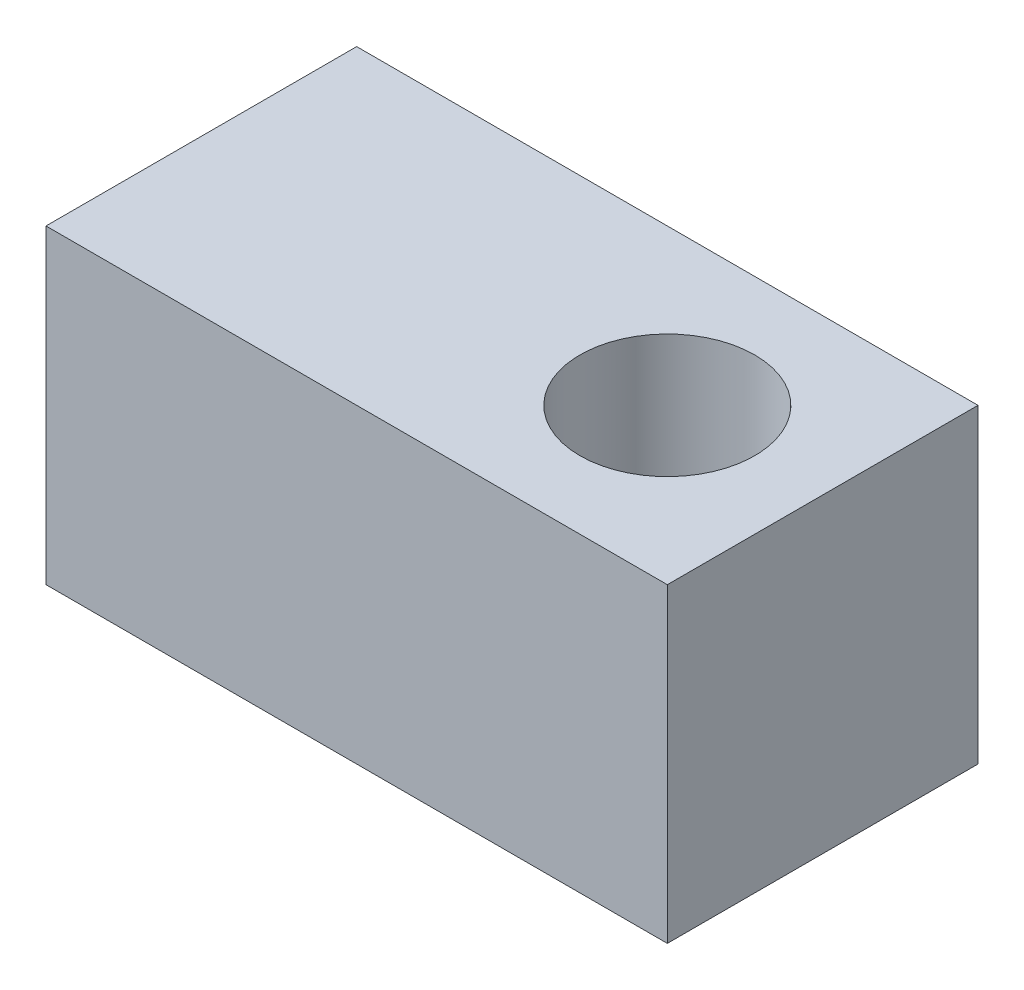
ISO-10303-21;
HEADER;
FILE_DESCRIPTION(('STEP AP214'),'2;1');
FILE_NAME('part.step','',(''),(''),'','','');
FILE_SCHEMA(('AUTOMOTIVE_DESIGN { 1 0 10303 214 1 1 1 1 }'));
ENDSEC;
DATA;
#1=APPLICATION_CONTEXT('core data for automotive mechanical design processes');
#2=APPLICATION_PROTOCOL_DEFINITION('international standard','automotive_design',2000,#1);
#3=PRODUCT_CONTEXT('',#1,'mechanical');
#4=PRODUCT('Part','Part','',(#3));
#5=PRODUCT_RELATED_PRODUCT_CATEGORY('part','',(#4));
#6=PRODUCT_DEFINITION_FORMATION('','',#4);
#7=PRODUCT_DEFINITION_CONTEXT('part definition',#1,'design');
#8=PRODUCT_DEFINITION('design','',#6,#7);
#9=PRODUCT_DEFINITION_SHAPE('','',#8);
#10=(LENGTH_UNIT() NAMED_UNIT(*) SI_UNIT(.MILLI.,.METRE.));
#11=(NAMED_UNIT(*) PLANE_ANGLE_UNIT() SI_UNIT($,.RADIAN.));
#12=(NAMED_UNIT(*) SI_UNIT($,.STERADIAN.) SOLID_ANGLE_UNIT());
#13=UNCERTAINTY_MEASURE_WITH_UNIT(LENGTH_MEASURE(1.E-05),#10,'distance_accuracy_value','');
#14=(GEOMETRIC_REPRESENTATION_CONTEXT(3) GLOBAL_UNCERTAINTY_ASSIGNED_CONTEXT((#13)) GLOBAL_UNIT_ASSIGNED_CONTEXT((#10,
#11,#12)) REPRESENTATION_CONTEXT('',''));
#15=CARTESIAN_POINT('',(0.,0.,0.));
#16=DIRECTION('',(0.,0.,1.));
#17=DIRECTION('',(1.,0.,0.));
#18=AXIS2_PLACEMENT_3D('',#15,#16,#17);
#19=CARTESIAN_POINT('',(50.8,50.8,25.4));
#20=DIRECTION('',(-1.,0.,0.));
#21=DIRECTION('',(0.,0.,1.));
#22=AXIS2_PLACEMENT_3D('',#19,#20,#21);
#23=PLANE('',#22);
#24=DIRECTION('',(0.,0.,-1.));
#25=VECTOR('',#24,1.);
#26=CARTESIAN_POINT('',(50.8,0.,25.4));
#27=LINE('',#26,#25);
#28=CARTESIAN_POINT('',(50.8,0.,25.4));
#29=VERTEX_POINT('',#28);
#30=CARTESIAN_POINT('',(50.8,0.,-25.4));
#31=VERTEX_POINT('',#30);
#32=EDGE_CURVE('E108',#29,#31,#27,.T.);
#33=ORIENTED_EDGE('',*,*,#32,.T.);
#34=DIRECTION('',(0.,-1.,0.));
#35=VECTOR('',#34,1.);
#36=CARTESIAN_POINT('',(50.8,50.8,-25.4));
#37=LINE('',#36,#35);
#38=CARTESIAN_POINT('',(50.8,50.8,-25.4));
#39=VERTEX_POINT('',#38);
#40=EDGE_CURVE('E11',#39,#31,#37,.T.);
#41=ORIENTED_EDGE('',*,*,#40,.F.);
#42=DIRECTION('',(0.,0.,-1.));
#43=VECTOR('',#42,1.);
#44=CARTESIAN_POINT('',(50.8,50.8,25.4));
#45=LINE('',#44,#43);
#46=CARTESIAN_POINT('',(50.8,50.8,25.4));
#47=VERTEX_POINT('',#46);
#48=EDGE_CURVE('E110',#47,#39,#45,.T.);
#49=ORIENTED_EDGE('',*,*,#48,.F.);
#50=DIRECTION('',(0.,-1.,0.));
#51=VECTOR('',#50,1.);
#52=CARTESIAN_POINT('',(50.8,50.8,25.4));
#53=LINE('',#52,#51);
#54=EDGE_CURVE('E116',#47,#29,#53,.T.);
#55=ORIENTED_EDGE('',*,*,#54,.T.);
#56=EDGE_LOOP('',(#33,#41,#49,#55));
#57=FACE_BOUND('',#56,.T.);
#58=ADVANCED_FACE('F37',(#57),#23,.F.);
#59=CARTESIAN_POINT('',(-50.8,50.8,-25.4));
#60=DIRECTION('',(0.,0.,1.));
#61=DIRECTION('',(1.,0.,0.));
#62=AXIS2_PLACEMENT_3D('',#59,#60,#61);
#63=PLANE('',#62);
#64=DIRECTION('',(-1.,0.,0.));
#65=VECTOR('',#64,1.);
#66=CARTESIAN_POINT('',(-50.8,0.,-25.4));
#67=LINE('',#66,#65);
#68=CARTESIAN_POINT('',(-50.8,0.,-25.4));
#69=VERTEX_POINT('',#68);
#70=EDGE_CURVE('E119',#31,#69,#67,.T.);
#71=ORIENTED_EDGE('',*,*,#70,.T.);
#72=DIRECTION('',(0.,-1.,0.));
#73=VECTOR('',#72,1.);
#74=CARTESIAN_POINT('',(-50.8,50.8,-25.4));
#75=LINE('',#74,#73);
#76=CARTESIAN_POINT('',(-50.8,50.8,-25.4));
#77=VERTEX_POINT('',#76);
#78=EDGE_CURVE('E45',#77,#69,#75,.T.);
#79=ORIENTED_EDGE('',*,*,#78,.F.);
#80=DIRECTION('',(-1.,0.,0.));
#81=VECTOR('',#80,1.);
#82=CARTESIAN_POINT('',(-50.8,50.8,-25.4));
#83=LINE('',#82,#81);
#84=EDGE_CURVE('E84',#39,#77,#83,.T.);
#85=ORIENTED_EDGE('',*,*,#84,.F.);
#86=ORIENTED_EDGE('',*,*,#40,.T.);
#87=EDGE_LOOP('',(#71,#79,#85,#86));
#88=FACE_BOUND('',#87,.T.);
#89=ADVANCED_FACE('F143',(#88),#63,.F.);
#90=CARTESIAN_POINT('',(-50.8,50.8,25.4));
#91=DIRECTION('',(1.,0.,0.));
#92=DIRECTION('',(0.,0.,-1.));
#93=AXIS2_PLACEMENT_3D('',#90,#91,#92);
#94=PLANE('',#93);
#95=DIRECTION('',(0.,0.,1.));
#96=VECTOR('',#95,1.);
#97=CARTESIAN_POINT('',(-50.8,0.,25.4));
#98=LINE('',#97,#96);
#99=CARTESIAN_POINT('',(-50.8,0.,25.4));
#100=VERTEX_POINT('',#99);
#101=EDGE_CURVE('E71',#69,#100,#98,.T.);
#102=ORIENTED_EDGE('',*,*,#101,.T.);
#103=DIRECTION('',(0.,-1.,0.));
#104=VECTOR('',#103,1.);
#105=CARTESIAN_POINT('',(-50.8,50.8,25.4));
#106=LINE('',#105,#104);
#107=CARTESIAN_POINT('',(-50.8,50.8,25.4));
#108=VERTEX_POINT('',#107);
#109=EDGE_CURVE('E124',#108,#100,#106,.T.);
#110=ORIENTED_EDGE('',*,*,#109,.F.);
#111=DIRECTION('',(0.,0.,1.));
#112=VECTOR('',#111,1.);
#113=CARTESIAN_POINT('',(-50.8,50.8,25.4));
#114=LINE('',#113,#112);
#115=EDGE_CURVE('E113',#77,#108,#114,.T.);
#116=ORIENTED_EDGE('',*,*,#115,.F.);
#117=ORIENTED_EDGE('',*,*,#78,.T.);
#118=EDGE_LOOP('',(#102,#110,#116,#117));
#119=FACE_BOUND('',#118,.T.);
#120=ADVANCED_FACE('F126',(#119),#94,.F.);
#121=CARTESIAN_POINT('',(-50.8,50.8,25.4));
#122=DIRECTION('',(0.,0.,-1.));
#123=DIRECTION('',(-1.,0.,0.));
#124=AXIS2_PLACEMENT_3D('',#121,#122,#123);
#125=PLANE('',#124);
#126=DIRECTION('',(1.,0.,0.));
#127=VECTOR('',#126,1.);
#128=CARTESIAN_POINT('',(-50.8,0.,25.4));
#129=LINE('',#128,#127);
#130=EDGE_CURVE('E77',#100,#29,#129,.T.);
#131=ORIENTED_EDGE('',*,*,#130,.T.);
#132=ORIENTED_EDGE('',*,*,#54,.F.);
#133=DIRECTION('',(1.,0.,0.));
#134=VECTOR('',#133,1.);
#135=CARTESIAN_POINT('',(-50.8,50.8,25.4));
#136=LINE('',#135,#134);
#137=EDGE_CURVE('E53',#108,#47,#136,.T.);
#138=ORIENTED_EDGE('',*,*,#137,.F.);
#139=ORIENTED_EDGE('',*,*,#109,.T.);
#140=EDGE_LOOP('',(#131,#132,#138,#139));
#141=FACE_BOUND('',#140,.T.);
#142=ADVANCED_FACE('F133',(#141),#125,.F.);
#143=CARTESIAN_POINT('',(0.,50.8,0.));
#144=DIRECTION('',(0.,-1.,0.));
#145=DIRECTION('',(0.,0.,-1.));
#146=AXIS2_PLACEMENT_3D('',#143,#144,#145);
#147=PLANE('',#146);
#148=CARTESIAN_POINT('',(25.4,50.8,0.));
#149=DIRECTION('',(0.,1.,0.));
#150=DIRECTION('',(0.,0.,1.));
#151=AXIS2_PLACEMENT_3D('',#148,#149,#150);
#152=CIRCLE('',#151,14.2875);
#153=CARTESIAN_POINT('',(25.4,50.8,14.2875));
#154=VERTEX_POINT('',#153);
#155=EDGE_CURVE('E102',#154,#154,#152,.T.);
#156=ORIENTED_EDGE('',*,*,#155,.F.);
#157=EDGE_LOOP('',(#156));
#158=FACE_BOUND('',#157,.T.);
#159=ORIENTED_EDGE('',*,*,#48,.T.);
#160=ORIENTED_EDGE('',*,*,#84,.T.);
#161=ORIENTED_EDGE('',*,*,#115,.T.);
#162=ORIENTED_EDGE('',*,*,#137,.T.);
#163=EDGE_LOOP('',(#159,#160,#161,#162));
#164=FACE_BOUND('',#163,.T.);
#165=ADVANCED_FACE('F135',(#158,#164),#147,.F.);
#166=CARTESIAN_POINT('',(0.,0.,0.));
#167=DIRECTION('',(0.,-1.,0.));
#168=DIRECTION('',(0.,0.,-1.));
#169=AXIS2_PLACEMENT_3D('',#166,#167,#168);
#170=PLANE('',#169);
#171=CARTESIAN_POINT('',(-44.45,0.,0.));
#172=DIRECTION('',(0.,-1.,0.));
#173=DIRECTION('',(0.,0.,-1.));
#174=AXIS2_PLACEMENT_3D('',#171,#172,#173);
#175=CIRCLE('',#174,2.70509999999999);
#176=CARTESIAN_POINT('',(-44.45,0.,-2.70509999999999));
#177=VERTEX_POINT('',#176);
#178=EDGE_CURVE('E99',#177,#177,#175,.T.);
#179=ORIENTED_EDGE('',*,*,#178,.F.);
#180=EDGE_LOOP('',(#179));
#181=FACE_BOUND('',#180,.T.);
#182=CARTESIAN_POINT('',(25.4,0.,0.));
#183=DIRECTION('',(0.,-1.,0.));
#184=DIRECTION('',(0.,0.,-1.));
#185=AXIS2_PLACEMENT_3D('',#182,#183,#184);
#186=CIRCLE('',#185,14.2875);
#187=CARTESIAN_POINT('',(25.4,0.,-14.2875));
#188=VERTEX_POINT('',#187);
#189=EDGE_CURVE('E98',#188,#188,#186,.F.);
#190=ORIENTED_EDGE('',*,*,#189,.T.);
#191=EDGE_LOOP('',(#190));
#192=FACE_BOUND('',#191,.T.);
#193=ORIENTED_EDGE('',*,*,#32,.F.);
#194=ORIENTED_EDGE('',*,*,#130,.F.);
#195=ORIENTED_EDGE('',*,*,#101,.F.);
#196=ORIENTED_EDGE('',*,*,#70,.F.);
#197=EDGE_LOOP('',(#193,#194,#195,#196));
#198=FACE_BOUND('',#197,.T.);
#199=ADVANCED_FACE('F129',(#181,#192,#198),#170,.T.);
#200=CARTESIAN_POINT('',(25.4,-0.001000000000001,0.));
#201=DIRECTION('',(0.,1.,0.));
#202=DIRECTION('',(0.,0.,1.));
#203=AXIS2_PLACEMENT_3D('',#200,#201,#202);
#204=CYLINDRICAL_SURFACE('',#203,14.2875);
#205=ORIENTED_EDGE('',*,*,#189,.F.);
#206=EDGE_LOOP('',(#205));
#207=FACE_BOUND('',#206,.T.);
#208=ORIENTED_EDGE('',*,*,#155,.T.);
#209=EDGE_LOOP('',(#208));
#210=FACE_BOUND('',#209,.T.);
#211=ADVANCED_FACE('F92',(#207,#210),#204,.F.);
#212=CARTESIAN_POINT('',(-44.45,28.12034,0.));
#213=DIRECTION('',(0.,-1.,0.));
#214=DIRECTION('',(0.,0.,-1.));
#215=AXIS2_PLACEMENT_3D('',#212,#213,#214);
#216=CONICAL_SURFACE('',#215,2.70509999999999,1.02974425867665);
#217=CARTESIAN_POINT('',(-44.45,29.7457280605315,0.));
#218=VERTEX_POINT('',#217);
#219=VERTEX_LOOP('',#218);
#220=FACE_BOUND('',#219,.T.);
#221=CARTESIAN_POINT('',(-44.45,28.12034,0.));
#222=DIRECTION('',(0.,-1.,0.));
#223=DIRECTION('',(0.,0.,-1.));
#224=AXIS2_PLACEMENT_3D('',#221,#222,#223);
#225=CIRCLE('',#224,2.70509999999999);
#226=CARTESIAN_POINT('',(-44.45,28.12034,-2.70509999999999));
#227=VERTEX_POINT('',#226);
#228=EDGE_CURVE('E96',#227,#227,#225,.T.);
#229=ORIENTED_EDGE('',*,*,#228,.T.);
#230=EDGE_LOOP('',(#229));
#231=FACE_BOUND('',#230,.T.);
#232=ADVANCED_FACE('F88',(#220,#231),#216,.F.);
#233=CARTESIAN_POINT('',(-44.45,0.,0.));
#234=DIRECTION('',(0.,-1.,0.));
#235=DIRECTION('',(0.,0.,-1.));
#236=AXIS2_PLACEMENT_3D('',#233,#234,#235);
#237=CYLINDRICAL_SURFACE('',#236,2.70509999999999);
#238=ORIENTED_EDGE('',*,*,#228,.F.);
#239=EDGE_LOOP('',(#238));
#240=FACE_BOUND('',#239,.T.);
#241=ORIENTED_EDGE('',*,*,#178,.T.);
#242=EDGE_LOOP('',(#241));
#243=FACE_BOUND('',#242,.T.);
#244=ADVANCED_FACE('F91',(#240,#243),#237,.F.);
#245=CLOSED_SHELL('',(#58,#89,#120,#142,#165,#199,#211,#232,#244));
#246=MANIFOLD_SOLID_BREP('B2',#245);
#247=ADVANCED_BREP_SHAPE_REPRESENTATION('',(#18,#246),#14);
#248=SHAPE_DEFINITION_REPRESENTATION(#9,#247);
ENDSEC;
END-ISO-10303-21;
